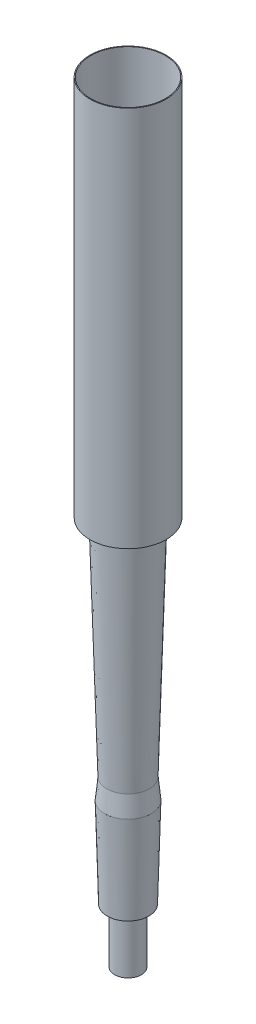
ISO-10303-21;
HEADER;
FILE_DESCRIPTION(('STEP AP214'),'2;1');
FILE_NAME('part.step','',(''),(''),'','','');
FILE_SCHEMA(('AUTOMOTIVE_DESIGN { 1 0 10303 214 1 1 1 1 }'));
ENDSEC;
DATA;
#1=APPLICATION_CONTEXT('core data for automotive mechanical design processes');
#2=APPLICATION_PROTOCOL_DEFINITION('international standard','automotive_design',2000,#1);
#3=PRODUCT_CONTEXT('',#1,'mechanical');
#4=PRODUCT('Part','Part','',(#3));
#5=PRODUCT_RELATED_PRODUCT_CATEGORY('part','',(#4));
#6=PRODUCT_DEFINITION_FORMATION('','',#4);
#7=PRODUCT_DEFINITION_CONTEXT('part definition',#1,'design');
#8=PRODUCT_DEFINITION('design','',#6,#7);
#9=PRODUCT_DEFINITION_SHAPE('','',#8);
#10=(LENGTH_UNIT() NAMED_UNIT(*) SI_UNIT(.MILLI.,.METRE.));
#11=(NAMED_UNIT(*) PLANE_ANGLE_UNIT() SI_UNIT($,.RADIAN.));
#12=(NAMED_UNIT(*) SI_UNIT($,.STERADIAN.) SOLID_ANGLE_UNIT());
#13=UNCERTAINTY_MEASURE_WITH_UNIT(LENGTH_MEASURE(1.E-05),#10,'distance_accuracy_value','');
#14=(GEOMETRIC_REPRESENTATION_CONTEXT(3) GLOBAL_UNCERTAINTY_ASSIGNED_CONTEXT((#13)) GLOBAL_UNIT_ASSIGNED_CONTEXT((#10,
#11,#12)) REPRESENTATION_CONTEXT('',''));
#15=CARTESIAN_POINT('',(0.,0.,0.));
#16=DIRECTION('',(0.,0.,1.));
#17=DIRECTION('',(1.,0.,0.));
#18=AXIS2_PLACEMENT_3D('',#15,#16,#17);
#19=CARTESIAN_POINT('',(0.,96.04,0.));
#20=DIRECTION('',(0.,-1.,0.));
#21=DIRECTION('',(0.,0.,-1.));
#22=AXIS2_PLACEMENT_3D('',#19,#20,#21);
#23=PLANE('',#22);
#24=CARTESIAN_POINT('',(0.,96.04,0.));
#25=DIRECTION('',(0.,-1.,0.));
#26=DIRECTION('',(0.,0.,-1.));
#27=AXIS2_PLACEMENT_3D('',#24,#25,#26);
#28=CIRCLE('',#27,4.65);
#29=CARTESIAN_POINT('',(0.,96.04,-4.65));
#30=VERTEX_POINT('',#29);
#31=EDGE_CURVE('E92',#30,#30,#28,.T.);
#32=ORIENTED_EDGE('',*,*,#31,.T.);
#33=EDGE_LOOP('',(#32));
#34=FACE_BOUND('',#33,.T.);
#35=CARTESIAN_POINT('',(0.,96.04,0.));
#36=DIRECTION('',(0.,-1.,0.));
#37=DIRECTION('',(0.,0.,-1.));
#38=AXIS2_PLACEMENT_3D('',#35,#36,#37);
#39=CIRCLE('',#38,4.75);
#40=CARTESIAN_POINT('',(0.,96.04,-4.75));
#41=VERTEX_POINT('',#40);
#42=EDGE_CURVE('E12',#41,#41,#39,.T.);
#43=ORIENTED_EDGE('',*,*,#42,.F.);
#44=EDGE_LOOP('',(#43));
#45=FACE_BOUND('',#44,.T.);
#46=ADVANCED_FACE('F57',(#34,#45),#23,.F.);
#47=CARTESIAN_POINT('',(0.,0.,0.));
#48=DIRECTION('',(0.,-1.,0.));
#49=DIRECTION('',(0.,0.,-1.));
#50=AXIS2_PLACEMENT_3D('',#47,#48,#49);
#51=CYLINDRICAL_SURFACE('',#50,4.75);
#52=ORIENTED_EDGE('',*,*,#42,.T.);
#53=EDGE_LOOP('',(#52));
#54=FACE_BOUND('',#53,.T.);
#55=CARTESIAN_POINT('',(0.,48.5,0.));
#56=DIRECTION('',(0.,-1.,0.));
#57=DIRECTION('',(0.,0.,-1.));
#58=AXIS2_PLACEMENT_3D('',#55,#56,#57);
#59=CIRCLE('',#58,4.75);
#60=CARTESIAN_POINT('',(0.,48.5,-4.75));
#61=VERTEX_POINT('',#60);
#62=EDGE_CURVE('E64',#61,#61,#59,.T.);
#63=ORIENTED_EDGE('',*,*,#62,.F.);
#64=EDGE_LOOP('',(#63));
#65=FACE_BOUND('',#64,.T.);
#66=ADVANCED_FACE('F103',(#54,#65),#51,.T.);
#67=CARTESIAN_POINT('',(0.,48.5,0.));
#68=DIRECTION('',(0.,-1.,0.));
#69=DIRECTION('',(0.,0.,-1.));
#70=AXIS2_PLACEMENT_3D('',#67,#68,#69);
#71=PLANE('',#70);
#72=ORIENTED_EDGE('',*,*,#62,.T.);
#73=EDGE_LOOP('',(#72));
#74=FACE_BOUND('',#73,.T.);
#75=CARTESIAN_POINT('',(0.,48.5,0.));
#76=DIRECTION('',(0.,-1.,0.));
#77=DIRECTION('',(0.,0.,-1.));
#78=AXIS2_PLACEMENT_3D('',#75,#76,#77);
#79=CIRCLE('',#78,3.45);
#80=CARTESIAN_POINT('',(0.,48.5,-3.45));
#81=VERTEX_POINT('',#80);
#82=EDGE_CURVE('E69',#81,#81,#79,.T.);
#83=ORIENTED_EDGE('',*,*,#82,.F.);
#84=EDGE_LOOP('',(#83));
#85=FACE_BOUND('',#84,.T.);
#86=ADVANCED_FACE('F101',(#74,#85),#71,.T.);
#87=CARTESIAN_POINT('',(0.,48.5,0.));
#88=DIRECTION('',(0.,1.,0.));
#89=DIRECTION('',(0.,0.,1.));
#90=AXIS2_PLACEMENT_3D('',#87,#88,#89);
#91=CONICAL_SURFACE('',#90,3.45,0.02856365783876);
#92=CARTESIAN_POINT('',(0.,20.5513171157665,0.));
#93=DIRECTION('',(0.,-1.,0.));
#94=DIRECTION('',(0.,0.,-1.));
#95=AXIS2_PLACEMENT_3D('',#92,#93,#94);
#96=CIRCLE('',#95,2.65146620330761);
#97=CARTESIAN_POINT('',(0.,20.5513171157665,-2.65146620330761));
#98=VERTEX_POINT('',#97);
#99=EDGE_CURVE('E72',#98,#98,#96,.F.);
#100=ORIENTED_EDGE('',*,*,#99,.T.);
#101=EDGE_LOOP('',(#100));
#102=FACE_BOUND('',#101,.T.);
#103=ORIENTED_EDGE('',*,*,#82,.T.);
#104=EDGE_LOOP('',(#103));
#105=FACE_BOUND('',#104,.T.);
#106=ADVANCED_FACE('F99',(#102,#105),#91,.T.);
#107=CARTESIAN_POINT('',(0.,0.,0.));
#108=DIRECTION('',(0.,-1.,0.));
#109=DIRECTION('',(0.,0.,-1.));
#110=AXIS2_PLACEMENT_3D('',#107,#108,#109);
#111=CYLINDRICAL_SURFACE('',#110,4.65);
#112=ORIENTED_EDGE('',*,*,#31,.F.);
#113=EDGE_LOOP('',(#112));
#114=FACE_BOUND('',#113,.T.);
#115=CARTESIAN_POINT('',(0.,48.6,0.));
#116=DIRECTION('',(0.,-1.,0.));
#117=DIRECTION('',(0.,0.,-1.));
#118=AXIS2_PLACEMENT_3D('',#115,#116,#117);
#119=CIRCLE('',#118,4.65);
#120=CARTESIAN_POINT('',(0.,48.6,-4.65));
#121=VERTEX_POINT('',#120);
#122=EDGE_CURVE('E89',#121,#121,#119,.T.);
#123=ORIENTED_EDGE('',*,*,#122,.T.);
#124=EDGE_LOOP('',(#123));
#125=FACE_BOUND('',#124,.T.);
#126=ADVANCED_FACE('F111',(#114,#125),#111,.F.);
#127=CARTESIAN_POINT('',(0.,48.6,0.));
#128=DIRECTION('',(0.,-1.,0.));
#129=DIRECTION('',(0.,0.,-1.));
#130=AXIS2_PLACEMENT_3D('',#127,#128,#129);
#131=PLANE('',#130);
#132=ORIENTED_EDGE('',*,*,#122,.F.);
#133=EDGE_LOOP('',(#132));
#134=FACE_BOUND('',#133,.T.);
#135=CARTESIAN_POINT('',(0.,48.6,0.));
#136=DIRECTION('',(0.,-1.,0.));
#137=DIRECTION('',(0.,0.,-1.));
#138=AXIS2_PLACEMENT_3D('',#135,#136,#137);
#139=CIRCLE('',#138,3.35281633485708);
#140=CARTESIAN_POINT('',(0.,48.6,-3.35281633485708));
#141=VERTEX_POINT('',#140);
#142=EDGE_CURVE('E79',#141,#141,#139,.T.);
#143=ORIENTED_EDGE('',*,*,#142,.T.);
#144=EDGE_LOOP('',(#143));
#145=FACE_BOUND('',#144,.T.);
#146=ADVANCED_FACE('F122',(#134,#145),#131,.F.);
#147=CARTESIAN_POINT('',(0.,48.5028559773899,0.));
#148=DIRECTION('',(0.,1.,0.));
#149=DIRECTION('',(0.,0.,1.));
#150=AXIS2_PLACEMENT_3D('',#147,#148,#149);
#151=CONICAL_SURFACE('',#150,3.35004079135393,0.02856365783876);
#152=CARTESIAN_POINT('',(0.,20.6,0.));
#153=DIRECTION('',(0.,1.,0.));
#154=DIRECTION('',(0.,0.,1.));
#155=AXIS2_PLACEMENT_3D('',#152,#153,#154);
#156=CIRCLE('',#155,2.55281633485708);
#157=CARTESIAN_POINT('',(0.,20.6,2.55281633485708));
#158=VERTEX_POINT('',#157);
#159=EDGE_CURVE('E74',#158,#158,#156,.F.);
#160=ORIENTED_EDGE('',*,*,#159,.T.);
#161=EDGE_LOOP('',(#160));
#162=FACE_BOUND('',#161,.T.);
#163=ORIENTED_EDGE('',*,*,#142,.F.);
#164=EDGE_LOOP('',(#163));
#165=FACE_BOUND('',#164,.T.);
#166=ADVANCED_FACE('F128',(#162,#165),#151,.F.);
#167=CARTESIAN_POINT('',(0.,20.6,0.));
#168=DIRECTION('',(0.,1.,0.));
#169=DIRECTION('',(0.,0.,1.));
#170=AXIS2_PLACEMENT_3D('',#167,#168,#169);
#171=PLANE('',#170);
#172=CARTESIAN_POINT('',(0.,20.6,0.));
#173=DIRECTION('',(0.,1.,0.));
#174=DIRECTION('',(0.,0.,1.));
#175=AXIS2_PLACEMENT_3D('',#172,#173,#174);
#176=CIRCLE('',#175,1.5);
#177=CARTESIAN_POINT('',(0.,20.6,1.5));
#178=VERTEX_POINT('',#177);
#179=EDGE_CURVE('E82',#178,#178,#176,.T.);
#180=ORIENTED_EDGE('',*,*,#179,.F.);
#181=EDGE_LOOP('',(#180));
#182=FACE_BOUND('',#181,.T.);
#183=ORIENTED_EDGE('',*,*,#159,.F.);
#184=EDGE_LOOP('',(#183));
#185=FACE_BOUND('',#184,.T.);
#186=ADVANCED_FACE('F133',(#182,#185),#171,.T.);
#187=CARTESIAN_POINT('',(0.,18.,0.));
#188=DIRECTION('',(0.,-1.,0.));
#189=DIRECTION('',(0.,0.,-1.));
#190=AXIS2_PLACEMENT_3D('',#187,#188,#189);
#191=CONICAL_SURFACE('',#190,2.9,0.0971075252405081);
#192=CARTESIAN_POINT('',(0.,18.,0.));
#193=DIRECTION('',(0.,-1.,0.));
#194=DIRECTION('',(0.,0.,-1.));
#195=AXIS2_PLACEMENT_3D('',#192,#193,#194);
#196=CIRCLE('',#195,2.9);
#197=CARTESIAN_POINT('',(0.,18.,-2.9));
#198=VERTEX_POINT('',#197);
#199=EDGE_CURVE('E75',#198,#198,#196,.T.);
#200=ORIENTED_EDGE('',*,*,#199,.F.);
#201=EDGE_LOOP('',(#200));
#202=FACE_BOUND('',#201,.T.);
#203=ORIENTED_EDGE('',*,*,#99,.F.);
#204=EDGE_LOOP('',(#203));
#205=FACE_BOUND('',#204,.T.);
#206=ADVANCED_FACE('F140',(#202,#205),#191,.T.);
#207=CARTESIAN_POINT('',(0.,18.1047667221748,0.));
#208=DIRECTION('',(0.,-1.,0.));
#209=DIRECTION('',(0.,0.,-1.));
#210=AXIS2_PLACEMENT_3D('',#207,#208,#209);
#211=CONICAL_SURFACE('',#210,0.,1.53468557504013);
#212=CARTESIAN_POINT('',(0.,18.0505770382913,0.));
#213=DIRECTION('',(0.,-1.,0.));
#214=DIRECTION('',(0.,0.,-1.));
#215=AXIS2_PLACEMENT_3D('',#212,#213,#214);
#216=CIRCLE('',#215,1.5);
#217=CARTESIAN_POINT('',(0.,18.0505770382913,1.5));
#218=VERTEX_POINT('',#217);
#219=EDGE_CURVE('E60',#218,#218,#216,.T.);
#220=ORIENTED_EDGE('',*,*,#219,.F.);
#221=EDGE_LOOP('',(#220));
#222=FACE_BOUND('',#221,.T.);
#223=ORIENTED_EDGE('',*,*,#199,.T.);
#224=EDGE_LOOP('',(#223));
#225=FACE_BOUND('',#224,.T.);
#226=ADVANCED_FACE('F144',(#222,#225),#211,.F.);
#227=CARTESIAN_POINT('',(0.,-1.2E-05,0.));
#228=DIRECTION('',(0.,1.,0.));
#229=DIRECTION('',(0.,0.,1.));
#230=AXIS2_PLACEMENT_3D('',#227,#228,#229);
#231=CYLINDRICAL_SURFACE('',#230,1.5);
#232=CARTESIAN_POINT('',(0.,20.6,1.5));
#233=CARTESIAN_POINT('',(0.,20.5734435108155,1.5));
#234=CARTESIAN_POINT('',(0.,20.5468870216311,1.5));
#235=CARTESIAN_POINT('',(0.,20.4937740432621,1.5));
#236=CARTESIAN_POINT('',(0.,20.4672175540777,1.5));
#237=CARTESIAN_POINT('',(0.,20.4141045757087,1.5));
#238=CARTESIAN_POINT('',(0.,20.3875480865243,1.5));
#239=CARTESIAN_POINT('',(0.,20.3344351081553,1.5));
#240=CARTESIAN_POINT('',(0.,20.3078786189709,1.5));
#241=CARTESIAN_POINT('',(0.,20.2547656406019,1.5));
#242=CARTESIAN_POINT('',(0.,20.2282091514175,1.5));
#243=CARTESIAN_POINT('',(0.,20.1750961730485,1.5));
#244=CARTESIAN_POINT('',(0.,20.1485396838641,1.5));
#245=CARTESIAN_POINT('',(0.,20.0954267054951,1.5));
#246=CARTESIAN_POINT('',(0.,20.0688702163107,1.5));
#247=CARTESIAN_POINT('',(0.,20.0157572379417,1.5));
#248=CARTESIAN_POINT('',(0.,19.9892007487573,1.5));
#249=CARTESIAN_POINT('',(0.,19.9360877703883,1.5));
#250=CARTESIAN_POINT('',(0.,19.9095312812039,1.5));
#251=CARTESIAN_POINT('',(0.,19.8564183028349,1.5));
#252=CARTESIAN_POINT('',(0.,19.8298618136505,1.5));
#253=CARTESIAN_POINT('',(0.,19.7767488352815,1.5));
#254=CARTESIAN_POINT('',(0.,19.7501923460971,1.5));
#255=CARTESIAN_POINT('',(0.,19.6970793677282,1.5));
#256=CARTESIAN_POINT('',(0.,19.6705228785437,1.5));
#257=CARTESIAN_POINT('',(0.,19.6174099001748,1.5));
#258=CARTESIAN_POINT('',(0.,19.5908534109903,1.5));
#259=CARTESIAN_POINT('',(0.,19.5377404326214,1.5));
#260=CARTESIAN_POINT('',(0.,19.5111839434369,1.5));
#261=CARTESIAN_POINT('',(0.,19.458070965068,1.5));
#262=CARTESIAN_POINT('',(0.,19.4315144758835,1.5));
#263=CARTESIAN_POINT('',(0.,19.3784014975146,1.5));
#264=CARTESIAN_POINT('',(0.,19.3518450083301,1.5));
#265=CARTESIAN_POINT('',(0.,19.2987320299612,1.5));
#266=CARTESIAN_POINT('',(0.,19.2721755407767,1.5));
#267=CARTESIAN_POINT('',(0.,19.2190625624078,1.5));
#268=CARTESIAN_POINT('',(0.,19.1925060732233,1.5));
#269=CARTESIAN_POINT('',(0.,19.1393930948544,1.5));
#270=CARTESIAN_POINT('',(0.,19.1128366056699,1.5));
#271=CARTESIAN_POINT('',(0.,19.059723627301,1.5));
#272=CARTESIAN_POINT('',(0.,19.0331671381165,1.5));
#273=CARTESIAN_POINT('',(0.,18.9800541597476,1.5));
#274=CARTESIAN_POINT('',(0.,18.9534976705631,1.5));
#275=CARTESIAN_POINT('',(0.,18.9003846921942,1.5));
#276=CARTESIAN_POINT('',(0.,18.8738282030097,1.5));
#277=CARTESIAN_POINT('',(0.,18.8207152246408,1.5));
#278=CARTESIAN_POINT('',(0.,18.7941587354563,1.5));
#279=CARTESIAN_POINT('',(0.,18.7410457570874,1.5));
#280=CARTESIAN_POINT('',(0.,18.7144892679029,1.5));
#281=CARTESIAN_POINT('',(0.,18.661376289534,1.5));
#282=CARTESIAN_POINT('',(0.,18.6348198003495,1.5));
#283=CARTESIAN_POINT('',(0.,18.5817068219806,1.5));
#284=CARTESIAN_POINT('',(0.,18.5551503327961,1.5));
#285=CARTESIAN_POINT('',(0.,18.5020373544272,1.5));
#286=CARTESIAN_POINT('',(0.,18.4754808652427,1.5));
#287=CARTESIAN_POINT('',(0.,18.4223678868738,1.5));
#288=CARTESIAN_POINT('',(0.,18.3958113976893,1.5));
#289=CARTESIAN_POINT('',(0.,18.3426984193204,1.5));
#290=CARTESIAN_POINT('',(0.,18.3161419301359,1.5));
#291=CARTESIAN_POINT('',(0.,18.263028951767,1.5));
#292=CARTESIAN_POINT('',(0.,18.2364724625825,1.5));
#293=CARTESIAN_POINT('',(0.,18.1833594842136,1.5));
#294=CARTESIAN_POINT('',(0.,18.1568029950291,1.5));
#295=CARTESIAN_POINT('',(0.,18.1036900166602,1.5));
#296=CARTESIAN_POINT('',(0.,18.0771335274757,1.5));
#297=CARTESIAN_POINT('',(0.,18.0505770382913,1.5));
#298=B_SPLINE_CURVE_WITH_KNOTS('',3,(#232,#233,#234,#235,#236,#237,#238,#239,#240,#241,#242,
#243,#244,#245,#246,#247,#248,#249,#250,#251,#252,#253,#254,#255,#256,#257,#258,#259,#260,#261,
#262,#263,#264,#265,#266,#267,#268,#269,#270,#271,#272,#273,#274,#275,#276,#277,#278,#279,#280,
#281,#282,#283,#284,#285,#286,#287,#288,#289,#290,#291,#292,#293,#294,#295,#296,#297),
.UNSPECIFIED.,.F.,.F.,(4,2,2,2,2,2,2,2,2,2,2,2,2,2,2,2,2,2,2,2,2,2,2,2,2,2,2,2,2,2,2,2,4),(0.,
0.0796694675533963,0.159338935106796,0.239008402660196,0.318677870213592,0.398347337766988,
0.478016805320388,0.557686272873788,0.637355740427184,0.71702520798058,0.79669467553398,
0.87636414308738,0.956033610640776,1.03570307819417,1.11537254574757,1.19504201330097,
1.27471148085437,1.35438094840776,1.43405041596116,1.51371988351456,1.59338935106796,
1.67305881862136,1.75272828617476,1.83239775372816,1.91206722128155,1.99173668883495,
2.07140615638835,2.15107562394175,2.23074509149514,2.31041455904854,2.39008402660194,
2.46975349415534,2.54942296170874),.UNSPECIFIED.);
#299=EDGE_CURVE('BSEAM147',#178,#218,#298,.T.);
#300=ORIENTED_EDGE('',*,*,#179,.T.);
#301=ORIENTED_EDGE('',*,*,#219,.T.);
#302=ORIENTED_EDGE('',*,*,#299,.T.);
#303=ORIENTED_EDGE('',*,*,#299,.F.);
#304=EDGE_LOOP('',(#300,#302,#301,#303));
#305=FACE_BOUND('',#304,.T.);
#306=ADVANCED_FACE('F147',(#305),#231,.F.);
#307=CLOSED_SHELL('',(#46,#66,#86,#106,#126,#146,#166,#186,#206,#226,#306));
#308=MANIFOLD_SOLID_BREP('B2',#307);
#309=CARTESIAN_POINT('',(0.,0.,0.));
#310=DIRECTION('',(0.,1.,0.));
#311=DIRECTION('',(0.,0.,1.));
#312=AXIS2_PLACEMENT_3D('',#309,#310,#311);
#313=PLANE('',#312);
#314=CARTESIAN_POINT('',(0.,0.,0.));
#315=DIRECTION('',(0.,1.,0.));
#316=DIRECTION('',(0.,0.,1.));
#317=AXIS2_PLACEMENT_3D('',#314,#315,#316);
#318=CIRCLE('',#317,1.67);
#319=CARTESIAN_POINT('',(0.,0.,1.67));
#320=VERTEX_POINT('',#319);
#321=EDGE_CURVE('E244',#320,#320,#318,.T.);
#322=ORIENTED_EDGE('',*,*,#321,.F.);
#323=EDGE_LOOP('',(#322));
#324=FACE_BOUND('',#323,.T.);
#325=CARTESIAN_POINT('',(0.,0.,0.));
#326=DIRECTION('',(0.,1.,0.));
#327=DIRECTION('',(0.,0.,1.));
#328=AXIS2_PLACEMENT_3D('',#325,#326,#327);
#329=CIRCLE('',#328,1.5);
#330=CARTESIAN_POINT('',(0.,0.,1.5));
#331=VERTEX_POINT('',#330);
#332=EDGE_CURVE('E249',#331,#331,#329,.T.);
#333=ORIENTED_EDGE('',*,*,#332,.T.);
#334=EDGE_LOOP('',(#333));
#335=FACE_BOUND('',#334,.T.);
#336=ADVANCED_FACE('F236',(#324,#335),#313,.F.);
#337=CARTESIAN_POINT('',(0.,6.8,0.));
#338=DIRECTION('',(0.,-1.,0.));
#339=DIRECTION('',(0.,0.,-1.));
#340=AXIS2_PLACEMENT_3D('',#337,#338,#339);
#341=CYLINDRICAL_SURFACE('',#340,1.67);
#342=CARTESIAN_POINT('',(0.,6.8,0.));
#343=DIRECTION('',(0.,1.,0.));
#344=DIRECTION('',(0.,0.,1.));
#345=AXIS2_PLACEMENT_3D('',#342,#343,#344);
#346=CIRCLE('',#345,1.67);
#347=CARTESIAN_POINT('',(0.,6.8,1.67));
#348=VERTEX_POINT('',#347);
#349=EDGE_CURVE('E56',#348,#348,#346,.T.);
#350=ORIENTED_EDGE('',*,*,#349,.F.);
#351=EDGE_LOOP('',(#350));
#352=FACE_BOUND('',#351,.T.);
#353=ORIENTED_EDGE('',*,*,#321,.T.);
#354=EDGE_LOOP('',(#353));
#355=FACE_BOUND('',#354,.T.);
#356=ADVANCED_FACE('F238',(#352,#355),#341,.T.);
#357=CARTESIAN_POINT('',(0.,6.8,0.));
#358=DIRECTION('',(0.,-1.,0.));
#359=DIRECTION('',(0.,0.,-1.));
#360=AXIS2_PLACEMENT_3D('',#357,#358,#359);
#361=CYLINDRICAL_SURFACE('',#360,1.5);
#362=ORIENTED_EDGE('',*,*,#332,.F.);
#363=EDGE_LOOP('',(#362));
#364=FACE_BOUND('',#363,.T.);
#365=CARTESIAN_POINT('',(0.,6.9,0.));
#366=DIRECTION('',(0.,-1.,0.));
#367=DIRECTION('',(1.,0.,0.));
#368=AXIS2_PLACEMENT_3D('',#365,#366,#367);
#369=CIRCLE('',#368,1.5);
#370=CARTESIAN_POINT('',(1.5,6.9,0.));
#371=VERTEX_POINT('',#370);
#372=EDGE_CURVE('E240',#371,#371,#369,.T.);
#373=ORIENTED_EDGE('',*,*,#372,.F.);
#374=EDGE_LOOP('',(#373));
#375=FACE_BOUND('',#374,.T.);
#376=ADVANCED_FACE('F272',(#364,#375),#361,.F.);
#377=CARTESIAN_POINT('',(0.,18.,0.));
#378=DIRECTION('',(0.,1.,0.));
#379=DIRECTION('',(-1.,0.,0.));
#380=AXIS2_PLACEMENT_3D('',#377,#378,#379);
#381=PLANE('',#380);
#382=CARTESIAN_POINT('',(0.,18.,0.));
#383=DIRECTION('',(0.,1.,0.));
#384=DIRECTION('',(-1.,0.,0.));
#385=AXIS2_PLACEMENT_3D('',#382,#383,#384);
#386=CIRCLE('',#385,2.79996413270782);
#387=CARTESIAN_POINT('',(-2.79996413270782,18.,0.));
#388=VERTEX_POINT('',#387);
#389=EDGE_CURVE('E259',#388,#388,#386,.F.);
#390=ORIENTED_EDGE('',*,*,#389,.T.);
#391=EDGE_LOOP('',(#390));
#392=FACE_BOUND('',#391,.T.);
#393=CARTESIAN_POINT('',(0.,18.,0.));
#394=DIRECTION('',(0.,-1.,0.));
#395=DIRECTION('',(1.,0.,0.));
#396=AXIS2_PLACEMENT_3D('',#393,#394,#395);
#397=CIRCLE('',#396,2.9);
#398=CARTESIAN_POINT('',(2.9,18.,0.));
#399=VERTEX_POINT('',#398);
#400=EDGE_CURVE('E253',#399,#399,#397,.T.);
#401=ORIENTED_EDGE('',*,*,#400,.F.);
#402=EDGE_LOOP('',(#401));
#403=FACE_BOUND('',#402,.T.);
#404=ADVANCED_FACE('F274',(#392,#403),#381,.T.);
#405=CARTESIAN_POINT('',(0.,6.8,0.));
#406=DIRECTION('',(0.,1.,0.));
#407=DIRECTION('',(-1.,0.,0.));
#408=AXIS2_PLACEMENT_3D('',#405,#406,#407);
#409=CONICAL_SURFACE('',#408,2.6,0.026779311019766);
#410=ORIENTED_EDGE('',*,*,#400,.T.);
#411=EDGE_LOOP('',(#410));
#412=FACE_BOUND('',#411,.T.);
#413=CARTESIAN_POINT('',(0.,6.8,0.));
#414=DIRECTION('',(0.,-1.,0.));
#415=DIRECTION('',(1.,0.,0.));
#416=AXIS2_PLACEMENT_3D('',#413,#414,#415);
#417=CIRCLE('',#416,2.6);
#418=CARTESIAN_POINT('',(2.6,6.8,0.));
#419=VERTEX_POINT('',#418);
#420=EDGE_CURVE('E256',#419,#419,#417,.T.);
#421=ORIENTED_EDGE('',*,*,#420,.F.);
#422=EDGE_LOOP('',(#421));
#423=FACE_BOUND('',#422,.T.);
#424=ADVANCED_FACE('F282',(#412,#423),#409,.T.);
#425=CARTESIAN_POINT('',(0.,6.8,0.));
#426=DIRECTION('',(0.,-1.,0.));
#427=DIRECTION('',(1.,0.,0.));
#428=AXIS2_PLACEMENT_3D('',#425,#426,#427);
#429=PLANE('',#428);
#430=ORIENTED_EDGE('',*,*,#349,.T.);
#431=EDGE_LOOP('',(#430));
#432=FACE_BOUND('',#431,.T.);
#433=ORIENTED_EDGE('',*,*,#420,.T.);
#434=EDGE_LOOP('',(#433));
#435=FACE_BOUND('',#434,.T.);
#436=ADVANCED_FACE('F313',(#432,#435),#429,.T.);
#437=CARTESIAN_POINT('',(0.,6.9,0.));
#438=DIRECTION('',(0.,-1.,0.));
#439=DIRECTION('',(1.,0.,0.));
#440=AXIS2_PLACEMENT_3D('',#437,#438,#439);
#441=PLANE('',#440);
#442=ORIENTED_EDGE('',*,*,#372,.T.);
#443=EDGE_LOOP('',(#442));
#444=FACE_BOUND('',#443,.T.);
#445=CARTESIAN_POINT('',(0.,6.9,0.));
#446=DIRECTION('',(0.,-1.,0.));
#447=DIRECTION('',(1.,0.,0.));
#448=AXIS2_PLACEMENT_3D('',#445,#446,#447);
#449=CIRCLE('',#448,2.50264270413639);
#450=CARTESIAN_POINT('',(2.50264270413639,6.9,0.));
#451=VERTEX_POINT('',#450);
#452=EDGE_CURVE('E262',#451,#451,#449,.T.);
#453=ORIENTED_EDGE('',*,*,#452,.F.);
#454=EDGE_LOOP('',(#453));
#455=FACE_BOUND('',#454,.T.);
#456=ADVANCED_FACE('F269',(#444,#455),#441,.F.);
#457=CARTESIAN_POINT('',(0.,6.802677611042,0.));
#458=DIRECTION('',(0.,1.,0.));
#459=DIRECTION('',(-1.,0.,0.));
#460=AXIS2_PLACEMENT_3D('',#457,#458,#459);
#461=CONICAL_SURFACE('',#460,2.50003585443216,0.026779311019766);
#462=ORIENTED_EDGE('',*,*,#389,.F.);
#463=EDGE_LOOP('',(#462));
#464=FACE_BOUND('',#463,.T.);
#465=ORIENTED_EDGE('',*,*,#452,.T.);
#466=EDGE_LOOP('',(#465));
#467=FACE_BOUND('',#466,.T.);
#468=ADVANCED_FACE('F332',(#464,#467),#461,.F.);
#469=CLOSED_SHELL('',(#336,#356,#376,#404,#424,#436,#456,#468));
#470=MANIFOLD_SOLID_BREP('B7',#469);
#471=ADVANCED_BREP_SHAPE_REPRESENTATION('',(#18,#308,#470),#14);
#472=SHAPE_DEFINITION_REPRESENTATION(#9,#471);
ENDSEC;
END-ISO-10303-21;
